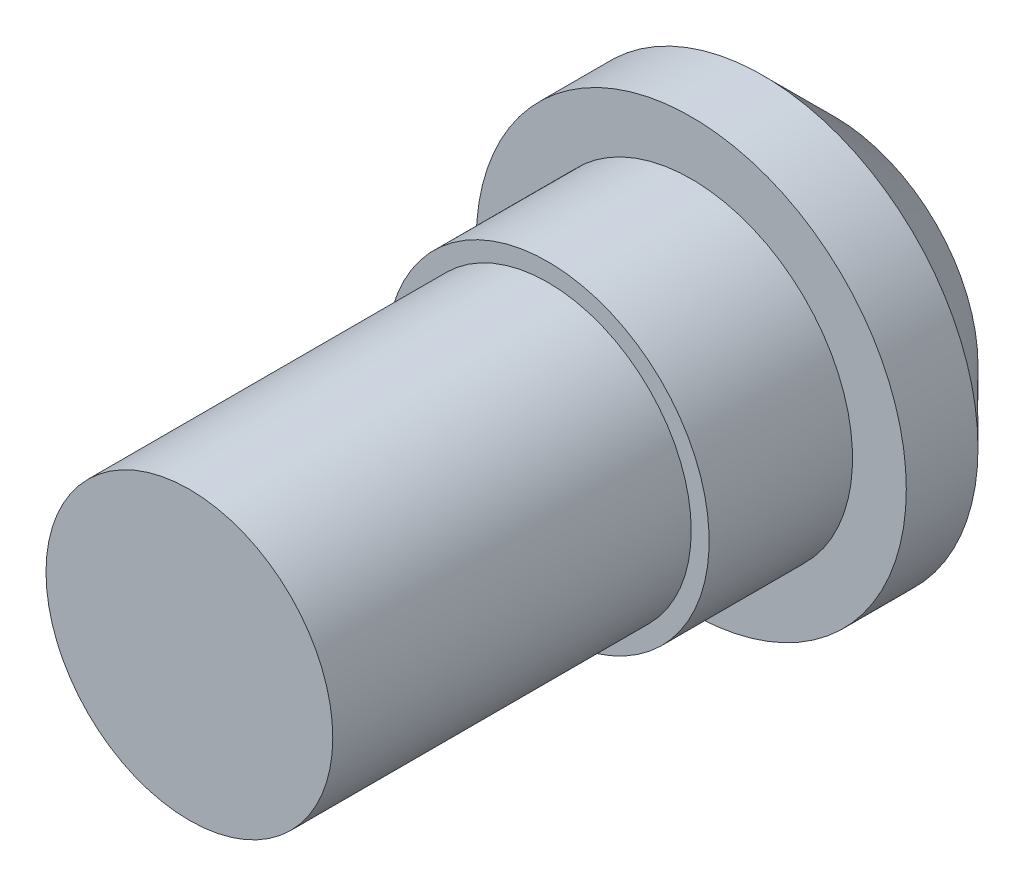
ISO-10303-21;
HEADER;
FILE_DESCRIPTION(('STEP AP214'),'2;1');
FILE_NAME('part.step','',(''),(''),'','','');
FILE_SCHEMA(('AUTOMOTIVE_DESIGN { 1 0 10303 214 1 1 1 1 }'));
ENDSEC;
DATA;
#1=APPLICATION_CONTEXT('core data for automotive mechanical design processes');
#2=APPLICATION_PROTOCOL_DEFINITION('international standard','automotive_design',2000,#1);
#3=PRODUCT_CONTEXT('',#1,'mechanical');
#4=PRODUCT('Part','Part','',(#3));
#5=PRODUCT_RELATED_PRODUCT_CATEGORY('part','',(#4));
#6=PRODUCT_DEFINITION_FORMATION('','',#4);
#7=PRODUCT_DEFINITION_CONTEXT('part definition',#1,'design');
#8=PRODUCT_DEFINITION('design','',#6,#7);
#9=PRODUCT_DEFINITION_SHAPE('','',#8);
#10=(LENGTH_UNIT() NAMED_UNIT(*) SI_UNIT(.MILLI.,.METRE.));
#11=(NAMED_UNIT(*) PLANE_ANGLE_UNIT() SI_UNIT($,.RADIAN.));
#12=(NAMED_UNIT(*) SI_UNIT($,.STERADIAN.) SOLID_ANGLE_UNIT());
#13=UNCERTAINTY_MEASURE_WITH_UNIT(LENGTH_MEASURE(1.E-05),#10,'distance_accuracy_value','');
#14=(GEOMETRIC_REPRESENTATION_CONTEXT(3) GLOBAL_UNCERTAINTY_ASSIGNED_CONTEXT((#13)) GLOBAL_UNIT_ASSIGNED_CONTEXT((#10,
#11,#12)) REPRESENTATION_CONTEXT('',''));
#15=CARTESIAN_POINT('',(0.,0.,0.));
#16=DIRECTION('',(0.,0.,1.));
#17=DIRECTION('',(1.,0.,0.));
#18=AXIS2_PLACEMENT_3D('',#15,#16,#17);
#19=CARTESIAN_POINT('',(0.,0.,0.));
#20=DIRECTION('',(0.,0.,-1.));
#21=DIRECTION('',(-1.,0.,0.));
#22=AXIS2_PLACEMENT_3D('',#19,#20,#21);
#23=PLANE('',#22);
#24=CARTESIAN_POINT('',(0.,0.,0.));
#25=DIRECTION('',(0.,0.,-1.));
#26=DIRECTION('',(-1.,0.,0.));
#27=AXIS2_PLACEMENT_3D('',#24,#25,#26);
#28=CIRCLE('',#27,4.00000000153169);
#29=CARTESIAN_POINT('',(-4.00000000153169,0.,0.));
#30=VERTEX_POINT('',#29);
#31=EDGE_CURVE('E11',#30,#30,#28,.T.);
#32=ORIENTED_EDGE('',*,*,#31,.T.);
#33=EDGE_LOOP('',(#32));
#34=FACE_BOUND('',#33,.T.);
#35=ADVANCED_FACE('F34',(#34),#23,.T.);
#36=CARTESIAN_POINT('',(0.,0.,0.));
#37=DIRECTION('',(0.,0.,1.));
#38=DIRECTION('',(1.,0.,0.));
#39=AXIS2_PLACEMENT_3D('',#36,#37,#38);
#40=CONICAL_SURFACE('',#39,4.00000000153169,0.78539816339745);
#41=CARTESIAN_POINT('',(0.,0.,2.));
#42=DIRECTION('',(0.,0.,-1.));
#43=DIRECTION('',(-1.,0.,0.));
#44=AXIS2_PLACEMENT_3D('',#41,#42,#43);
#45=CIRCLE('',#44,6.00000000153169);
#46=CARTESIAN_POINT('',(-6.00000000153169,0.,2.));
#47=VERTEX_POINT('',#46);
#48=EDGE_CURVE('E40',#47,#47,#45,.T.);
#49=ORIENTED_EDGE('',*,*,#48,.T.);
#50=EDGE_LOOP('',(#49));
#51=FACE_BOUND('',#50,.T.);
#52=ORIENTED_EDGE('',*,*,#31,.F.);
#53=EDGE_LOOP('',(#52));
#54=FACE_BOUND('',#53,.T.);
#55=ADVANCED_FACE('F75',(#51,#54),#40,.T.);
#56=CARTESIAN_POINT('',(0.,0.,0.));
#57=DIRECTION('',(0.,0.,-1.));
#58=DIRECTION('',(-1.,0.,0.));
#59=AXIS2_PLACEMENT_3D('',#56,#57,#58);
#60=CYLINDRICAL_SURFACE('',#59,6.00000000153169);
#61=CARTESIAN_POINT('',(0.,0.,4.));
#62=DIRECTION('',(0.,0.,-1.));
#63=DIRECTION('',(-1.,0.,0.));
#64=AXIS2_PLACEMENT_3D('',#61,#62,#63);
#65=CIRCLE('',#64,6.00000000153169);
#66=CARTESIAN_POINT('',(-6.00000000153169,0.,4.));
#67=VERTEX_POINT('',#66);
#68=EDGE_CURVE('E44',#67,#67,#65,.T.);
#69=ORIENTED_EDGE('',*,*,#68,.T.);
#70=EDGE_LOOP('',(#69));
#71=FACE_BOUND('',#70,.T.);
#72=ORIENTED_EDGE('',*,*,#48,.F.);
#73=EDGE_LOOP('',(#72));
#74=FACE_BOUND('',#73,.T.);
#75=ADVANCED_FACE('F79',(#71,#74),#60,.T.);
#76=CARTESIAN_POINT('',(0.,6.00000000153169,4.));
#77=DIRECTION('',(0.,0.,1.));
#78=DIRECTION('',(1.,0.,0.));
#79=AXIS2_PLACEMENT_3D('',#76,#77,#78);
#80=PLANE('',#79);
#81=CARTESIAN_POINT('',(0.,0.,4.));
#82=DIRECTION('',(0.,0.,-1.));
#83=DIRECTION('',(-1.,0.,0.));
#84=AXIS2_PLACEMENT_3D('',#81,#82,#83);
#85=CIRCLE('',#84,4.5);
#86=CARTESIAN_POINT('',(-4.5,0.,4.));
#87=VERTEX_POINT('',#86);
#88=EDGE_CURVE('E48',#87,#87,#85,.T.);
#89=ORIENTED_EDGE('',*,*,#88,.T.);
#90=EDGE_LOOP('',(#89));
#91=FACE_BOUND('',#90,.T.);
#92=ORIENTED_EDGE('',*,*,#68,.F.);
#93=EDGE_LOOP('',(#92));
#94=FACE_BOUND('',#93,.T.);
#95=ADVANCED_FACE('F83',(#91,#94),#80,.T.);
#96=CARTESIAN_POINT('',(0.,0.,0.));
#97=DIRECTION('',(0.,0.,-1.));
#98=DIRECTION('',(-1.,0.,0.));
#99=AXIS2_PLACEMENT_3D('',#96,#97,#98);
#100=CYLINDRICAL_SURFACE('',#99,4.5);
#101=CARTESIAN_POINT('',(0.,0.,8.));
#102=DIRECTION('',(0.,0.,-1.));
#103=DIRECTION('',(-1.,0.,0.));
#104=AXIS2_PLACEMENT_3D('',#101,#102,#103);
#105=CIRCLE('',#104,4.5);
#106=CARTESIAN_POINT('',(-4.5,0.,8.));
#107=VERTEX_POINT('',#106);
#108=EDGE_CURVE('E53',#107,#107,#105,.T.);
#109=ORIENTED_EDGE('',*,*,#108,.T.);
#110=EDGE_LOOP('',(#109));
#111=FACE_BOUND('',#110,.T.);
#112=ORIENTED_EDGE('',*,*,#88,.F.);
#113=EDGE_LOOP('',(#112));
#114=FACE_BOUND('',#113,.T.);
#115=ADVANCED_FACE('F90',(#111,#114),#100,.T.);
#116=CARTESIAN_POINT('',(0.,4.00000000153169,8.));
#117=DIRECTION('',(0.,0.,1.));
#118=DIRECTION('',(1.,0.,0.));
#119=AXIS2_PLACEMENT_3D('',#116,#117,#118);
#120=PLANE('',#119);
#121=CARTESIAN_POINT('',(0.,0.,8.));
#122=DIRECTION('',(0.,0.,-1.));
#123=DIRECTION('',(-1.,0.,0.));
#124=AXIS2_PLACEMENT_3D('',#121,#122,#123);
#125=CIRCLE('',#124,4.00000000153169);
#126=CARTESIAN_POINT('',(-4.00000000153169,0.,8.));
#127=VERTEX_POINT('',#126);
#128=EDGE_CURVE('E56',#127,#127,#125,.T.);
#129=ORIENTED_EDGE('',*,*,#128,.T.);
#130=EDGE_LOOP('',(#129));
#131=FACE_BOUND('',#130,.T.);
#132=ORIENTED_EDGE('',*,*,#108,.F.);
#133=EDGE_LOOP('',(#132));
#134=FACE_BOUND('',#133,.T.);
#135=ADVANCED_FACE('F72',(#131,#134),#120,.T.);
#136=CARTESIAN_POINT('',(0.,0.,0.));
#137=DIRECTION('',(0.,0.,-1.));
#138=DIRECTION('',(-1.,0.,0.));
#139=AXIS2_PLACEMENT_3D('',#136,#137,#138);
#140=CYLINDRICAL_SURFACE('',#139,4.00000000153169);
#141=CARTESIAN_POINT('',(0.,0.,18.));
#142=DIRECTION('',(0.,0.,-1.));
#143=DIRECTION('',(-1.,0.,0.));
#144=AXIS2_PLACEMENT_3D('',#141,#142,#143);
#145=CIRCLE('',#144,4.00000000153169);
#146=CARTESIAN_POINT('',(-4.00000000153169,0.,18.));
#147=VERTEX_POINT('',#146);
#148=EDGE_CURVE('E59',#147,#147,#145,.T.);
#149=ORIENTED_EDGE('',*,*,#148,.T.);
#150=EDGE_LOOP('',(#149));
#151=FACE_BOUND('',#150,.T.);
#152=ORIENTED_EDGE('',*,*,#128,.F.);
#153=EDGE_LOOP('',(#152));
#154=FACE_BOUND('',#153,.T.);
#155=ADVANCED_FACE('F63',(#151,#154),#140,.T.);
#156=CARTESIAN_POINT('',(0.,4.00000000153169,18.));
#157=DIRECTION('',(0.,0.,1.));
#158=DIRECTION('',(1.,0.,0.));
#159=AXIS2_PLACEMENT_3D('',#156,#157,#158);
#160=PLANE('',#159);
#161=ORIENTED_EDGE('',*,*,#148,.F.);
#162=EDGE_LOOP('',(#161));
#163=FACE_BOUND('',#162,.T.);
#164=ADVANCED_FACE('F66',(#163),#160,.T.);
#165=CLOSED_SHELL('',(#35,#55,#75,#95,#115,#135,#155,#164));
#166=MANIFOLD_SOLID_BREP('B2',#165);
#167=ADVANCED_BREP_SHAPE_REPRESENTATION('',(#18,#166),#14);
#168=SHAPE_DEFINITION_REPRESENTATION(#9,#167);
ENDSEC;
END-ISO-10303-21;
